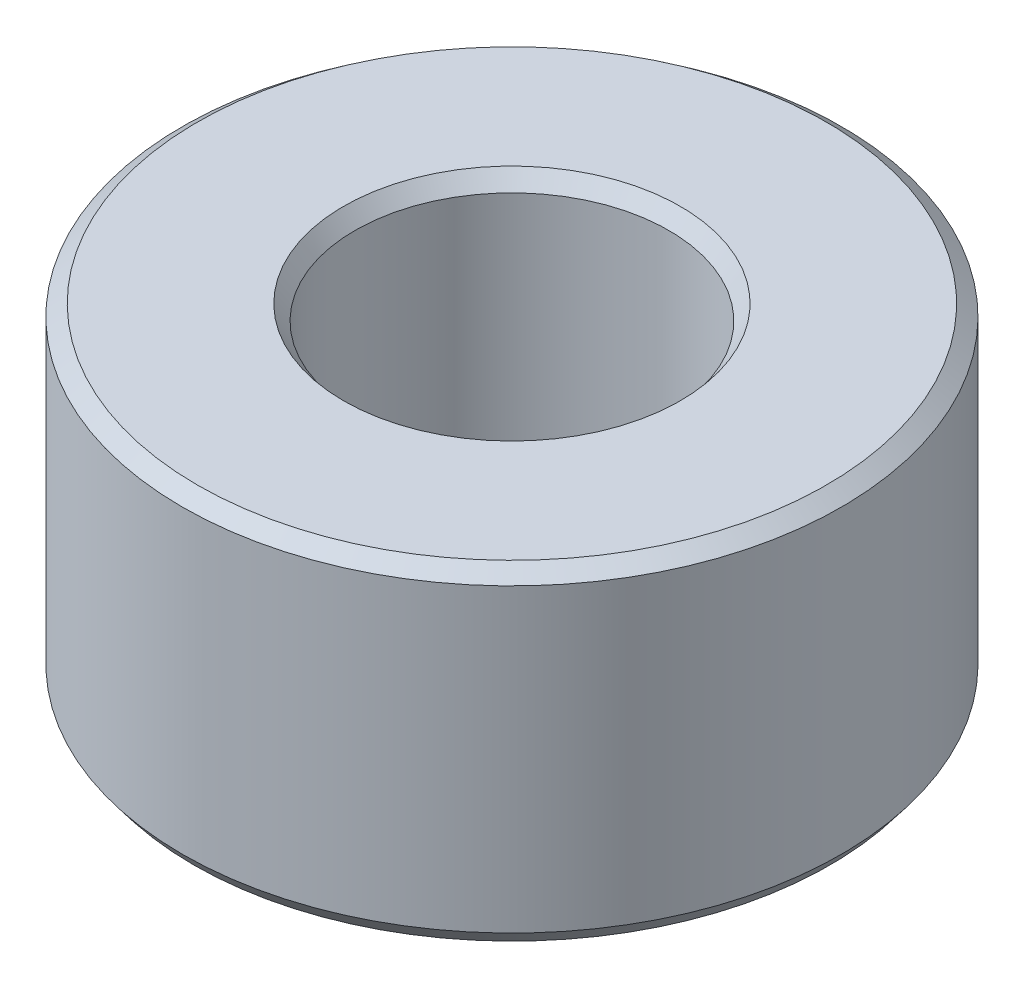
ISO-10303-21;
HEADER;
FILE_DESCRIPTION(('STEP AP214'),'2;1');
FILE_NAME('part.step','',(''),(''),'','','');
FILE_SCHEMA(('AUTOMOTIVE_DESIGN { 1 0 10303 214 1 1 1 1 }'));
ENDSEC;
DATA;
#1=APPLICATION_CONTEXT('core data for automotive mechanical design processes');
#2=APPLICATION_PROTOCOL_DEFINITION('international standard','automotive_design',2000,#1);
#3=PRODUCT_CONTEXT('',#1,'mechanical');
#4=PRODUCT('Part','Part','',(#3));
#5=PRODUCT_RELATED_PRODUCT_CATEGORY('part','',(#4));
#6=PRODUCT_DEFINITION_FORMATION('','',#4);
#7=PRODUCT_DEFINITION_CONTEXT('part definition',#1,'design');
#8=PRODUCT_DEFINITION('design','',#6,#7);
#9=PRODUCT_DEFINITION_SHAPE('','',#8);
#10=(LENGTH_UNIT() NAMED_UNIT(*) SI_UNIT(.MILLI.,.METRE.));
#11=(NAMED_UNIT(*) PLANE_ANGLE_UNIT() SI_UNIT($,.RADIAN.));
#12=(NAMED_UNIT(*) SI_UNIT($,.STERADIAN.) SOLID_ANGLE_UNIT());
#13=UNCERTAINTY_MEASURE_WITH_UNIT(LENGTH_MEASURE(1.E-05),#10,'distance_accuracy_value','');
#14=(GEOMETRIC_REPRESENTATION_CONTEXT(3) GLOBAL_UNCERTAINTY_ASSIGNED_CONTEXT((#13)) GLOBAL_UNIT_ASSIGNED_CONTEXT((#10,
#11,#12)) REPRESENTATION_CONTEXT('',''));
#15=CARTESIAN_POINT('',(0.,0.,0.));
#16=DIRECTION('',(0.,0.,1.));
#17=DIRECTION('',(1.,0.,0.));
#18=AXIS2_PLACEMENT_3D('',#15,#16,#17);
#19=CARTESIAN_POINT('',(0.,57.0969376470747,0.));
#20=DIRECTION('',(0.,-1.,0.));
#21=DIRECTION('',(0.,0.,-1.));
#22=AXIS2_PLACEMENT_3D('',#19,#20,#21);
#23=CYLINDRICAL_SURFACE('',#22,57.5);
#24=CARTESIAN_POINT('',(0.,2.63563521294846,0.));
#25=DIRECTION('',(0.,1.,0.));
#26=DIRECTION('',(0.,0.,1.));
#27=AXIS2_PLACEMENT_3D('',#24,#25,#26);
#28=CIRCLE('',#27,57.5);
#29=CARTESIAN_POINT('',(0.,2.63563521294846,57.5));
#30=VERTEX_POINT('',#29);
#31=EDGE_CURVE('E10',#30,#30,#28,.T.);
#32=ORIENTED_EDGE('',*,*,#31,.T.);
#33=EDGE_LOOP('',(#32));
#34=FACE_BOUND('',#33,.T.);
#35=CARTESIAN_POINT('',(0.,55.0929529637414,0.));
#36=DIRECTION('',(0.,1.,0.));
#37=DIRECTION('',(0.,0.,1.));
#38=AXIS2_PLACEMENT_3D('',#35,#36,#37);
#39=CIRCLE('',#38,57.5);
#40=CARTESIAN_POINT('',(0.,55.0929529637414,57.5));
#41=VERTEX_POINT('',#40);
#42=EDGE_CURVE('E50',#41,#41,#39,.F.);
#43=ORIENTED_EDGE('',*,*,#42,.T.);
#44=EDGE_LOOP('',(#43));
#45=FACE_BOUND('',#44,.T.);
#46=ADVANCED_FACE('F39',(#34,#45),#23,.T.);
#47=CARTESIAN_POINT('',(0.,57.0969376470747,0.));
#48=DIRECTION('',(0.,1.,0.));
#49=DIRECTION('',(0.,0.,1.));
#50=AXIS2_PLACEMENT_3D('',#47,#48,#49);
#51=PLANE('',#50);
#52=CARTESIAN_POINT('',(0.,57.0969376470747,0.));
#53=DIRECTION('',(0.,1.,0.));
#54=DIRECTION('',(0.,0.,1.));
#55=AXIS2_PLACEMENT_3D('',#52,#53,#54);
#56=CIRCLE('',#55,29.3845641947429);
#57=CARTESIAN_POINT('',(0.,57.0969376470747,29.3845641947429));
#58=VERTEX_POINT('',#57);
#59=EDGE_CURVE('E58',#58,#58,#56,.F.);
#60=ORIENTED_EDGE('',*,*,#59,.T.);
#61=EDGE_LOOP('',(#60));
#62=FACE_BOUND('',#61,.T.);
#63=CARTESIAN_POINT('',(0.,57.0969376470747,0.));
#64=DIRECTION('',(0.,1.,0.));
#65=DIRECTION('',(0.,0.,1.));
#66=AXIS2_PLACEMENT_3D('',#63,#64,#65);
#67=CIRCLE('',#66,54.8643647870515);
#68=CARTESIAN_POINT('',(0.,57.0969376470747,54.8643647870515));
#69=VERTEX_POINT('',#68);
#70=EDGE_CURVE('E61',#69,#69,#67,.T.);
#71=ORIENTED_EDGE('',*,*,#70,.T.);
#72=EDGE_LOOP('',(#71));
#73=FACE_BOUND('',#72,.T.);
#74=ADVANCED_FACE('F88',(#62,#73),#51,.T.);
#75=CARTESIAN_POINT('',(0.,0.,0.));
#76=DIRECTION('',(0.,1.,0.));
#77=DIRECTION('',(0.,0.,1.));
#78=AXIS2_PLACEMENT_3D('',#75,#76,#77);
#79=PLANE('',#78);
#80=CARTESIAN_POINT('',(0.,0.,0.));
#81=DIRECTION('',(0.,1.,0.));
#82=DIRECTION('',(0.,0.,1.));
#83=AXIS2_PLACEMENT_3D('',#80,#81,#82);
#84=CIRCLE('',#83,30.0162147243581);
#85=CARTESIAN_POINT('',(0.,0.,30.0162147243581));
#86=VERTEX_POINT('',#85);
#87=EDGE_CURVE('E51',#86,#86,#84,.T.);
#88=ORIENTED_EDGE('',*,*,#87,.T.);
#89=EDGE_LOOP('',(#88));
#90=FACE_BOUND('',#89,.T.);
#91=CARTESIAN_POINT('',(0.,0.,0.));
#92=DIRECTION('',(0.,1.,0.));
#93=DIRECTION('',(0.,0.,1.));
#94=AXIS2_PLACEMENT_3D('',#91,#92,#93);
#95=CIRCLE('',#94,55.4960153166667);
#96=CARTESIAN_POINT('',(0.,0.,55.4960153166667));
#97=VERTEX_POINT('',#96);
#98=EDGE_CURVE('E54',#97,#97,#95,.F.);
#99=ORIENTED_EDGE('',*,*,#98,.T.);
#100=EDGE_LOOP('',(#99));
#101=FACE_BOUND('',#100,.T.);
#102=ADVANCED_FACE('F83',(#90,#101),#79,.F.);
#103=CARTESIAN_POINT('',(0.,57.0969376470747,0.));
#104=DIRECTION('',(0.,-1.,0.));
#105=DIRECTION('',(0.,0.,-1.));
#106=AXIS2_PLACEMENT_3D('',#103,#104,#105);
#107=CYLINDRICAL_SURFACE('',#106,27.3805795114096);
#108=CARTESIAN_POINT('',(0.,54.4613024341263,0.));
#109=DIRECTION('',(0.,1.,0.));
#110=DIRECTION('',(0.,0.,1.));
#111=AXIS2_PLACEMENT_3D('',#108,#109,#110);
#112=CIRCLE('',#111,27.3805795114096);
#113=CARTESIAN_POINT('',(0.,54.4613024341263,27.3805795114096));
#114=VERTEX_POINT('',#113);
#115=EDGE_CURVE('E67',#114,#114,#112,.T.);
#116=ORIENTED_EDGE('',*,*,#115,.T.);
#117=EDGE_LOOP('',(#116));
#118=FACE_BOUND('',#117,.T.);
#119=CARTESIAN_POINT('',(0.,2.00398468333332,0.));
#120=DIRECTION('',(0.,1.,0.));
#121=DIRECTION('',(0.,0.,1.));
#122=AXIS2_PLACEMENT_3D('',#119,#120,#121);
#123=CIRCLE('',#122,27.3805795114096);
#124=CARTESIAN_POINT('',(0.,2.00398468333332,27.3805795114096));
#125=VERTEX_POINT('',#124);
#126=EDGE_CURVE('E69',#125,#125,#123,.F.);
#127=ORIENTED_EDGE('',*,*,#126,.T.);
#128=EDGE_LOOP('',(#127));
#129=FACE_BOUND('',#128,.T.);
#130=ADVANCED_FACE('F71',(#118,#129),#107,.F.);
#131=CARTESIAN_POINT('',(0.,54.4613024341263,0.));
#132=DIRECTION('',(0.,1.,0.));
#133=DIRECTION('',(0.,0.,1.));
#134=AXIS2_PLACEMENT_3D('',#131,#132,#133);
#135=CONICAL_SURFACE('',#134,27.3805795114096,0.65008732713303);
#136=ORIENTED_EDGE('',*,*,#59,.F.);
#137=EDGE_LOOP('',(#136));
#138=FACE_BOUND('',#137,.T.);
#139=ORIENTED_EDGE('',*,*,#115,.F.);
#140=EDGE_LOOP('',(#139));
#141=FACE_BOUND('',#140,.T.);
#142=ADVANCED_FACE('F77',(#138,#141),#135,.F.);
#143=CARTESIAN_POINT('',(0.,0.,0.));
#144=DIRECTION('',(0.,-1.,0.));
#145=DIRECTION('',(0.,0.,-1.));
#146=AXIS2_PLACEMENT_3D('',#143,#144,#145);
#147=CONICAL_SURFACE('',#146,30.0162147243581,0.920708999661864);
#148=ORIENTED_EDGE('',*,*,#126,.F.);
#149=EDGE_LOOP('',(#148));
#150=FACE_BOUND('',#149,.T.);
#151=ORIENTED_EDGE('',*,*,#87,.F.);
#152=EDGE_LOOP('',(#151));
#153=FACE_BOUND('',#152,.T.);
#154=ADVANCED_FACE('F73',(#150,#153),#147,.F.);
#155=CARTESIAN_POINT('',(0.,2.63563521294846,0.));
#156=DIRECTION('',(0.,1.,0.));
#157=DIRECTION('',(0.,0.,1.));
#158=AXIS2_PLACEMENT_3D('',#155,#156,#157);
#159=CONICAL_SURFACE('',#158,57.5,0.650087327133034);
#160=ORIENTED_EDGE('',*,*,#98,.F.);
#161=EDGE_LOOP('',(#160));
#162=FACE_BOUND('',#161,.T.);
#163=ORIENTED_EDGE('',*,*,#31,.F.);
#164=EDGE_LOOP('',(#163));
#165=FACE_BOUND('',#164,.T.);
#166=ADVANCED_FACE('F76',(#162,#165),#159,.T.);
#167=CARTESIAN_POINT('',(0.,57.0969376470747,0.));
#168=DIRECTION('',(0.,-1.,0.));
#169=DIRECTION('',(0.,0.,-1.));
#170=AXIS2_PLACEMENT_3D('',#167,#168,#169);
#171=CONICAL_SURFACE('',#170,54.8643647870515,0.920708999661859);
#172=ORIENTED_EDGE('',*,*,#42,.F.);
#173=EDGE_LOOP('',(#172));
#174=FACE_BOUND('',#173,.T.);
#175=ORIENTED_EDGE('',*,*,#70,.F.);
#176=EDGE_LOOP('',(#175));
#177=FACE_BOUND('',#176,.T.);
#178=ADVANCED_FACE('F45',(#174,#177),#171,.T.);
#179=CLOSED_SHELL('',(#46,#74,#102,#130,#142,#154,#166,#178));
#180=MANIFOLD_SOLID_BREP('B2',#179);
#181=ADVANCED_BREP_SHAPE_REPRESENTATION('',(#18,#180),#14);
#182=SHAPE_DEFINITION_REPRESENTATION(#9,#181);
ENDSEC;
END-ISO-10303-21;
